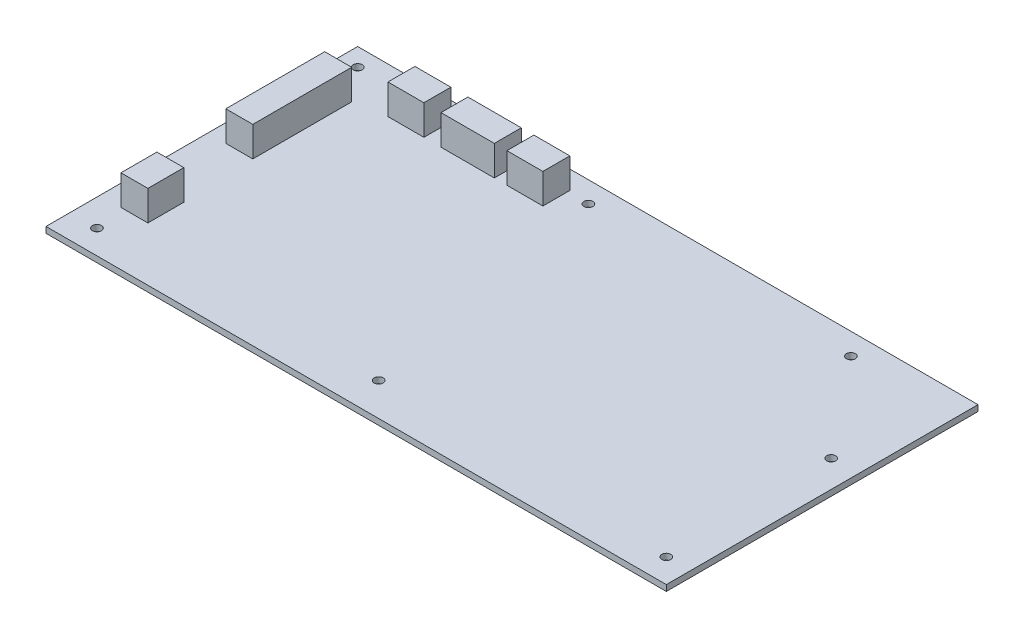
ISO-10303-21;
HEADER;
FILE_DESCRIPTION(('STEP AP214'),'2;1');
FILE_NAME('part.step','',(''),(''),'','','');
FILE_SCHEMA(('AUTOMOTIVE_DESIGN { 1 0 10303 214 1 1 1 1 }'));
ENDSEC;
DATA;
#1=APPLICATION_CONTEXT('core data for automotive mechanical design processes');
#2=APPLICATION_PROTOCOL_DEFINITION('international standard','automotive_design',2000,#1);
#3=PRODUCT_CONTEXT('',#1,'mechanical');
#4=PRODUCT('Part','Part','',(#3));
#5=PRODUCT_RELATED_PRODUCT_CATEGORY('part','',(#4));
#6=PRODUCT_DEFINITION_FORMATION('','',#4);
#7=PRODUCT_DEFINITION_CONTEXT('part definition',#1,'design');
#8=PRODUCT_DEFINITION('design','',#6,#7);
#9=PRODUCT_DEFINITION_SHAPE('','',#8);
#10=(LENGTH_UNIT() NAMED_UNIT(*) SI_UNIT(.MILLI.,.METRE.));
#11=(NAMED_UNIT(*) PLANE_ANGLE_UNIT() SI_UNIT($,.RADIAN.));
#12=(NAMED_UNIT(*) SI_UNIT($,.STERADIAN.) SOLID_ANGLE_UNIT());
#13=UNCERTAINTY_MEASURE_WITH_UNIT(LENGTH_MEASURE(1.E-05),#10,'distance_accuracy_value','');
#14=(GEOMETRIC_REPRESENTATION_CONTEXT(3) GLOBAL_UNCERTAINTY_ASSIGNED_CONTEXT((#13)) GLOBAL_UNIT_ASSIGNED_CONTEXT((#10,
#11,#12)) REPRESENTATION_CONTEXT('',''));
#15=CARTESIAN_POINT('',(0.,0.,0.));
#16=DIRECTION('',(0.,0.,1.));
#17=DIRECTION('',(1.,0.,0.));
#18=AXIS2_PLACEMENT_3D('',#15,#16,#17);
#19=CARTESIAN_POINT('',(0.,2.,0.));
#20=DIRECTION('',(0.,-1.,0.));
#21=DIRECTION('',(0.,0.,-1.));
#22=AXIS2_PLACEMENT_3D('',#19,#20,#21);
#23=PLANE('',#22);
#24=DIRECTION('',(0.,0.,1.));
#25=VECTOR('',#24,1.);
#26=CARTESIAN_POINT('',(-60.5,2.,-45.8));
#27=LINE('',#26,#25);
#28=CARTESIAN_POINT('',(-60.5,2.,-45.8));
#29=VERTEX_POINT('',#28);
#30=CARTESIAN_POINT('',(-60.5,2.,-36.8));
#31=VERTEX_POINT('',#30);
#32=EDGE_CURVE('E225',#29,#31,#27,.T.);
#33=ORIENTED_EDGE('',*,*,#32,.F.);
#34=DIRECTION('',(-1.,0.,0.));
#35=VECTOR('',#34,1.);
#36=CARTESIAN_POINT('',(-60.5,2.,-45.8));
#37=LINE('',#36,#35);
#38=CARTESIAN_POINT('',(-42.7,2.,-45.8));
#39=VERTEX_POINT('',#38);
#40=EDGE_CURVE('E241',#39,#29,#37,.T.);
#41=ORIENTED_EDGE('',*,*,#40,.F.);
#42=DIRECTION('',(0.,0.,-1.));
#43=VECTOR('',#42,1.);
#44=CARTESIAN_POINT('',(-42.7,2.,-45.8));
#45=LINE('',#44,#43);
#46=CARTESIAN_POINT('',(-42.7,2.,-36.8));
#47=VERTEX_POINT('',#46);
#48=EDGE_CURVE('E254',#47,#39,#45,.T.);
#49=ORIENTED_EDGE('',*,*,#48,.F.);
#50=DIRECTION('',(1.,0.,0.));
#51=VECTOR('',#50,1.);
#52=CARTESIAN_POINT('',(-60.5,2.,-36.8));
#53=LINE('',#52,#51);
#54=EDGE_CURVE('E230',#31,#47,#53,.T.);
#55=ORIENTED_EDGE('',*,*,#54,.F.);
#56=EDGE_LOOP('',(#33,#41,#49,#55));
#57=FACE_BOUND('',#56,.T.);
#58=DIRECTION('',(0.,0.,1.));
#59=VECTOR('',#58,1.);
#60=CARTESIAN_POINT('',(-96.5,2.,22.));
#61=LINE('',#60,#59);
#62=CARTESIAN_POINT('',(-96.5,2.,22.));
#63=VERTEX_POINT('',#62);
#64=CARTESIAN_POINT('',(-96.5,2.,34.));
#65=VERTEX_POINT('',#64);
#66=EDGE_CURVE('E321',#63,#65,#61,.T.);
#67=ORIENTED_EDGE('',*,*,#66,.F.);
#68=DIRECTION('',(-1.,0.,0.));
#69=VECTOR('',#68,1.);
#70=CARTESIAN_POINT('',(-96.5,2.,22.));
#71=LINE('',#70,#69);
#72=CARTESIAN_POINT('',(-87.5,2.,22.));
#73=VERTEX_POINT('',#72);
#74=EDGE_CURVE('E327',#73,#63,#71,.T.);
#75=ORIENTED_EDGE('',*,*,#74,.F.);
#76=DIRECTION('',(0.,0.,-1.));
#77=VECTOR('',#76,1.);
#78=CARTESIAN_POINT('',(-87.5,2.,22.));
#79=LINE('',#78,#77);
#80=CARTESIAN_POINT('',(-87.5,2.,34.));
#81=VERTEX_POINT('',#80);
#82=EDGE_CURVE('E344',#81,#73,#79,.T.);
#83=ORIENTED_EDGE('',*,*,#82,.F.);
#84=DIRECTION('',(1.,0.,0.));
#85=VECTOR('',#84,1.);
#86=CARTESIAN_POINT('',(-96.5,2.,34.));
#87=LINE('',#86,#85);
#88=EDGE_CURVE('E340',#65,#81,#87,.T.);
#89=ORIENTED_EDGE('',*,*,#88,.F.);
#90=EDGE_LOOP('',(#67,#75,#83,#89));
#91=FACE_BOUND('',#90,.T.);
#92=DIRECTION('',(0.,0.,-1.));
#93=VECTOR('',#92,1.);
#94=CARTESIAN_POINT('',(103.5,2.,52.));
#95=LINE('',#94,#93);
#96=CARTESIAN_POINT('',(103.5,2.,52.));
#97=VERTEX_POINT('',#96);
#98=CARTESIAN_POINT('',(103.5,2.,-52.));
#99=VERTEX_POINT('',#98);
#100=EDGE_CURVE('E468',#97,#99,#95,.T.);
#101=ORIENTED_EDGE('',*,*,#100,.T.);
#102=DIRECTION('',(-1.,0.,0.));
#103=VECTOR('',#102,1.);
#104=CARTESIAN_POINT('',(-103.5,2.,-52.));
#105=LINE('',#104,#103);
#106=CARTESIAN_POINT('',(-103.5,2.,-52.));
#107=VERTEX_POINT('',#106);
#108=EDGE_CURVE('E472',#99,#107,#105,.T.);
#109=ORIENTED_EDGE('',*,*,#108,.T.);
#110=DIRECTION('',(0.,0.,1.));
#111=VECTOR('',#110,1.);
#112=CARTESIAN_POINT('',(-103.5,2.,52.));
#113=LINE('',#112,#111);
#114=CARTESIAN_POINT('',(-103.5,2.,52.));
#115=VERTEX_POINT('',#114);
#116=EDGE_CURVE('E476',#107,#115,#113,.T.);
#117=ORIENTED_EDGE('',*,*,#116,.T.);
#118=DIRECTION('',(1.,0.,0.));
#119=VECTOR('',#118,1.);
#120=CARTESIAN_POINT('',(-103.5,2.,52.));
#121=LINE('',#120,#119);
#122=EDGE_CURVE('E479',#115,#97,#121,.T.);
#123=ORIENTED_EDGE('',*,*,#122,.T.);
#124=EDGE_LOOP('',(#101,#109,#117,#123));
#125=FACE_BOUND('',#124,.T.);
#126=CARTESIAN_POINT('',(-97.5,2.,-46.));
#127=DIRECTION('',(0.,1.,0.));
#128=DIRECTION('',(0.,0.,1.));
#129=AXIS2_PLACEMENT_3D('',#126,#127,#128);
#130=CIRCLE('',#129,1.5);
#131=CARTESIAN_POINT('',(-97.5,2.,-44.5));
#132=VERTEX_POINT('',#131);
#133=EDGE_CURVE('E432',#132,#132,#130,.T.);
#134=ORIENTED_EDGE('',*,*,#133,.F.);
#135=EDGE_LOOP('',(#134));
#136=FACE_BOUND('',#135,.T.);
#137=CARTESIAN_POINT('',(-94.5,2.,44.));
#138=DIRECTION('',(0.,1.,0.));
#139=DIRECTION('',(0.,0.,1.));
#140=AXIS2_PLACEMENT_3D('',#137,#138,#139);
#141=CIRCLE('',#140,1.5);
#142=CARTESIAN_POINT('',(-94.5,2.,45.5));
#143=VERTEX_POINT('',#142);
#144=EDGE_CURVE('E411',#143,#143,#141,.T.);
#145=ORIENTED_EDGE('',*,*,#144,.F.);
#146=EDGE_LOOP('',(#145));
#147=FACE_BOUND('',#146,.T.);
#148=CARTESIAN_POINT('',(-3.50000000000002,2.,41.));
#149=DIRECTION('',(0.,1.,0.));
#150=DIRECTION('',(0.,0.,1.));
#151=AXIS2_PLACEMENT_3D('',#148,#149,#150);
#152=CIRCLE('',#151,1.5);
#153=CARTESIAN_POINT('',(-3.50000000000002,2.,42.5));
#154=VERTEX_POINT('',#153);
#155=EDGE_CURVE('E417',#154,#154,#152,.T.);
#156=ORIENTED_EDGE('',*,*,#155,.F.);
#157=EDGE_LOOP('',(#156));
#158=FACE_BOUND('',#157,.T.);
#159=CARTESIAN_POINT('',(95.5,2.,44.));
#160=DIRECTION('',(0.,1.,0.));
#161=DIRECTION('',(0.,0.,1.));
#162=AXIS2_PLACEMENT_3D('',#159,#160,#161);
#163=CIRCLE('',#162,1.5);
#164=CARTESIAN_POINT('',(95.5,2.,45.5));
#165=VERTEX_POINT('',#164);
#166=EDGE_CURVE('E416',#165,#165,#163,.T.);
#167=ORIENTED_EDGE('',*,*,#166,.F.);
#168=EDGE_LOOP('',(#167));
#169=FACE_BOUND('',#168,.T.);
#170=CARTESIAN_POINT('',(94.5,2.,-12.));
#171=DIRECTION('',(0.,1.,0.));
#172=DIRECTION('',(0.,0.,1.));
#173=AXIS2_PLACEMENT_3D('',#170,#171,#172);
#174=CIRCLE('',#173,1.5);
#175=CARTESIAN_POINT('',(94.5,2.,-10.5));
#176=VERTEX_POINT('',#175);
#177=EDGE_CURVE('E449',#176,#176,#174,.T.);
#178=ORIENTED_EDGE('',*,*,#177,.F.);
#179=EDGE_LOOP('',(#178));
#180=FACE_BOUND('',#179,.T.);
#181=CARTESIAN_POINT('',(68.3,2.,-44.8));
#182=DIRECTION('',(0.,1.,0.));
#183=DIRECTION('',(0.,0.,1.));
#184=AXIS2_PLACEMENT_3D('',#181,#182,#183);
#185=CIRCLE('',#184,1.5);
#186=CARTESIAN_POINT('',(68.3,2.,-43.3));
#187=VERTEX_POINT('',#186);
#188=EDGE_CURVE('E441',#187,#187,#185,.T.);
#189=ORIENTED_EDGE('',*,*,#188,.F.);
#190=EDGE_LOOP('',(#189));
#191=FACE_BOUND('',#190,.T.);
#192=CARTESIAN_POINT('',(-19.5,2.,-45.));
#193=DIRECTION('',(0.,1.,0.));
#194=DIRECTION('',(0.,0.,1.));
#195=AXIS2_PLACEMENT_3D('',#192,#193,#194);
#196=CIRCLE('',#195,1.5);
#197=CARTESIAN_POINT('',(-19.5,2.,-43.5));
#198=VERTEX_POINT('',#197);
#199=EDGE_CURVE('E433',#198,#198,#196,.T.);
#200=ORIENTED_EDGE('',*,*,#199,.F.);
#201=EDGE_LOOP('',(#200));
#202=FACE_BOUND('',#201,.T.);
#203=DIRECTION('',(0.,0.,1.));
#204=VECTOR('',#203,1.);
#205=CARTESIAN_POINT('',(-97.5,2.,-35.));
#206=LINE('',#205,#204);
#207=CARTESIAN_POINT('',(-97.5,2.,-35.));
#208=VERTEX_POINT('',#207);
#209=CARTESIAN_POINT('',(-97.5,2.,-1.99999999999999));
#210=VERTEX_POINT('',#209);
#211=EDGE_CURVE('E366',#208,#210,#206,.T.);
#212=ORIENTED_EDGE('',*,*,#211,.F.);
#213=DIRECTION('',(-1.,0.,0.));
#214=VECTOR('',#213,1.);
#215=CARTESIAN_POINT('',(-97.5,2.,-35.));
#216=LINE('',#215,#214);
#217=CARTESIAN_POINT('',(-88.5,2.,-35.));
#218=VERTEX_POINT('',#217);
#219=EDGE_CURVE('E372',#218,#208,#216,.T.);
#220=ORIENTED_EDGE('',*,*,#219,.F.);
#221=DIRECTION('',(0.,0.,-1.));
#222=VECTOR('',#221,1.);
#223=CARTESIAN_POINT('',(-88.5,2.,-35.));
#224=LINE('',#223,#222);
#225=CARTESIAN_POINT('',(-88.5,2.,-1.99999999999999));
#226=VERTEX_POINT('',#225);
#227=EDGE_CURVE('E389',#226,#218,#224,.T.);
#228=ORIENTED_EDGE('',*,*,#227,.F.);
#229=DIRECTION('',(1.,0.,0.));
#230=VECTOR('',#229,1.);
#231=CARTESIAN_POINT('',(-97.5,2.,-1.99999999999999));
#232=LINE('',#231,#230);
#233=EDGE_CURVE('E385',#210,#226,#232,.T.);
#234=ORIENTED_EDGE('',*,*,#233,.F.);
#235=EDGE_LOOP('',(#212,#220,#228,#234));
#236=FACE_BOUND('',#235,.T.);
#237=DIRECTION('',(0.,0.,1.));
#238=VECTOR('',#237,1.);
#239=CARTESIAN_POINT('',(-78.2,2.,-45.8));
#240=LINE('',#239,#238);
#241=CARTESIAN_POINT('',(-78.2,2.,-45.8));
#242=VERTEX_POINT('',#241);
#243=CARTESIAN_POINT('',(-78.2,2.,-36.8));
#244=VERTEX_POINT('',#243);
#245=EDGE_CURVE('E276',#242,#244,#240,.T.);
#246=ORIENTED_EDGE('',*,*,#245,.F.);
#247=DIRECTION('',(-1.,0.,0.));
#248=VECTOR('',#247,1.);
#249=CARTESIAN_POINT('',(-78.2,2.,-45.8));
#250=LINE('',#249,#248);
#251=CARTESIAN_POINT('',(-66.2,2.,-45.8));
#252=VERTEX_POINT('',#251);
#253=EDGE_CURVE('E282',#252,#242,#250,.T.);
#254=ORIENTED_EDGE('',*,*,#253,.F.);
#255=DIRECTION('',(0.,0.,-1.));
#256=VECTOR('',#255,1.);
#257=CARTESIAN_POINT('',(-66.2,2.,-45.8));
#258=LINE('',#257,#256);
#259=CARTESIAN_POINT('',(-66.2,2.,-36.8));
#260=VERTEX_POINT('',#259);
#261=EDGE_CURVE('E299',#260,#252,#258,.T.);
#262=ORIENTED_EDGE('',*,*,#261,.F.);
#263=DIRECTION('',(1.,0.,0.));
#264=VECTOR('',#263,1.);
#265=CARTESIAN_POINT('',(-78.2,2.,-36.8));
#266=LINE('',#265,#264);
#267=EDGE_CURVE('E295',#244,#260,#266,.T.);
#268=ORIENTED_EDGE('',*,*,#267,.F.);
#269=EDGE_LOOP('',(#246,#254,#262,#268));
#270=FACE_BOUND('',#269,.T.);
#271=DIRECTION('',(0.,0.,1.));
#272=VECTOR('',#271,1.);
#273=CARTESIAN_POINT('',(-38.5,2.,-45.8));
#274=LINE('',#273,#272);
#275=CARTESIAN_POINT('',(-38.5,2.,-45.8));
#276=VERTEX_POINT('',#275);
#277=CARTESIAN_POINT('',(-38.5,2.,-36.8));
#278=VERTEX_POINT('',#277);
#279=EDGE_CURVE('E223',#276,#278,#274,.T.);
#280=ORIENTED_EDGE('',*,*,#279,.F.);
#281=DIRECTION('',(-1.,0.,0.));
#282=VECTOR('',#281,1.);
#283=CARTESIAN_POINT('',(-38.5,2.,-45.8));
#284=LINE('',#283,#282);
#285=CARTESIAN_POINT('',(-26.5,2.,-45.8));
#286=VERTEX_POINT('',#285);
#287=EDGE_CURVE('E220',#286,#276,#284,.T.);
#288=ORIENTED_EDGE('',*,*,#287,.F.);
#289=DIRECTION('',(0.,0.,-1.));
#290=VECTOR('',#289,1.);
#291=CARTESIAN_POINT('',(-26.5,2.,-45.8));
#292=LINE('',#291,#290);
#293=CARTESIAN_POINT('',(-26.5,2.,-36.8));
#294=VERTEX_POINT('',#293);
#295=EDGE_CURVE('E60',#294,#286,#292,.T.);
#296=ORIENTED_EDGE('',*,*,#295,.F.);
#297=DIRECTION('',(1.,0.,0.));
#298=VECTOR('',#297,1.);
#299=CARTESIAN_POINT('',(-38.5,2.,-36.8));
#300=LINE('',#299,#298);
#301=EDGE_CURVE('E55',#278,#294,#300,.T.);
#302=ORIENTED_EDGE('',*,*,#301,.F.);
#303=EDGE_LOOP('',(#280,#288,#296,#302));
#304=FACE_BOUND('',#303,.T.);
#305=ADVANCED_FACE('F39',(#57,#91,#125,#136,#147,#158,#169,#180,#191,#202,#236,#270,#304),#23,.F.);
#306=CARTESIAN_POINT('',(103.5,2.,52.));
#307=DIRECTION('',(-1.,0.,0.));
#308=DIRECTION('',(0.,0.,1.));
#309=AXIS2_PLACEMENT_3D('',#306,#307,#308);
#310=PLANE('',#309);
#311=DIRECTION('',(0.,0.,-1.));
#312=VECTOR('',#311,1.);
#313=CARTESIAN_POINT('',(103.5,0.,52.));
#314=LINE('',#313,#312);
#315=CARTESIAN_POINT('',(103.5,0.,52.));
#316=VERTEX_POINT('',#315);
#317=CARTESIAN_POINT('',(103.5,0.,-52.));
#318=VERTEX_POINT('',#317);
#319=EDGE_CURVE('E464',#316,#318,#314,.T.);
#320=ORIENTED_EDGE('',*,*,#319,.T.);
#321=DIRECTION('',(0.,-1.,0.));
#322=VECTOR('',#321,1.);
#323=CARTESIAN_POINT('',(103.5,2.,-52.));
#324=LINE('',#323,#322);
#325=EDGE_CURVE('E11',#99,#318,#324,.T.);
#326=ORIENTED_EDGE('',*,*,#325,.F.);
#327=ORIENTED_EDGE('',*,*,#100,.F.);
#328=DIRECTION('',(0.,-1.,0.));
#329=VECTOR('',#328,1.);
#330=CARTESIAN_POINT('',(103.5,2.,52.));
#331=LINE('',#330,#329);
#332=EDGE_CURVE('E482',#97,#316,#331,.T.);
#333=ORIENTED_EDGE('',*,*,#332,.T.);
#334=EDGE_LOOP('',(#320,#326,#327,#333));
#335=FACE_BOUND('',#334,.T.);
#336=ADVANCED_FACE('F41',(#335),#310,.F.);
#337=CARTESIAN_POINT('',(-103.5,2.,-52.));
#338=DIRECTION('',(0.,0.,1.));
#339=DIRECTION('',(1.,0.,0.));
#340=AXIS2_PLACEMENT_3D('',#337,#338,#339);
#341=PLANE('',#340);
#342=DIRECTION('',(-1.,0.,0.));
#343=VECTOR('',#342,1.);
#344=CARTESIAN_POINT('',(-103.5,0.,-52.));
#345=LINE('',#344,#343);
#346=CARTESIAN_POINT('',(-103.5,0.,-52.));
#347=VERTEX_POINT('',#346);
#348=EDGE_CURVE('E486',#318,#347,#345,.T.);
#349=ORIENTED_EDGE('',*,*,#348,.T.);
#350=DIRECTION('',(0.,-1.,0.));
#351=VECTOR('',#350,1.);
#352=CARTESIAN_POINT('',(-103.5,2.,-52.));
#353=LINE('',#352,#351);
#354=EDGE_CURVE('E48',#107,#347,#353,.T.);
#355=ORIENTED_EDGE('',*,*,#354,.F.);
#356=ORIENTED_EDGE('',*,*,#108,.F.);
#357=ORIENTED_EDGE('',*,*,#325,.T.);
#358=EDGE_LOOP('',(#349,#355,#356,#357));
#359=FACE_BOUND('',#358,.T.);
#360=ADVANCED_FACE('F522',(#359),#341,.F.);
#361=CARTESIAN_POINT('',(-103.5,2.,52.));
#362=DIRECTION('',(1.,0.,0.));
#363=DIRECTION('',(0.,0.,-1.));
#364=AXIS2_PLACEMENT_3D('',#361,#362,#363);
#365=PLANE('',#364);
#366=DIRECTION('',(0.,0.,1.));
#367=VECTOR('',#366,1.);
#368=CARTESIAN_POINT('',(-103.5,0.,52.));
#369=LINE('',#368,#367);
#370=CARTESIAN_POINT('',(-103.5,0.,52.));
#371=VERTEX_POINT('',#370);
#372=EDGE_CURVE('E489',#347,#371,#369,.T.);
#373=ORIENTED_EDGE('',*,*,#372,.T.);
#374=DIRECTION('',(0.,-1.,0.));
#375=VECTOR('',#374,1.);
#376=CARTESIAN_POINT('',(-103.5,2.,52.));
#377=LINE('',#376,#375);
#378=EDGE_CURVE('E497',#115,#371,#377,.T.);
#379=ORIENTED_EDGE('',*,*,#378,.F.);
#380=ORIENTED_EDGE('',*,*,#116,.F.);
#381=ORIENTED_EDGE('',*,*,#354,.T.);
#382=EDGE_LOOP('',(#373,#379,#380,#381));
#383=FACE_BOUND('',#382,.T.);
#384=ADVANCED_FACE('F506',(#383),#365,.F.);
#385=CARTESIAN_POINT('',(-103.5,2.,52.));
#386=DIRECTION('',(0.,0.,-1.));
#387=DIRECTION('',(-1.,0.,0.));
#388=AXIS2_PLACEMENT_3D('',#385,#386,#387);
#389=PLANE('',#388);
#390=DIRECTION('',(1.,0.,0.));
#391=VECTOR('',#390,1.);
#392=CARTESIAN_POINT('',(-103.5,0.,52.));
#393=LINE('',#392,#391);
#394=EDGE_CURVE('E473',#371,#316,#393,.T.);
#395=ORIENTED_EDGE('',*,*,#394,.T.);
#396=ORIENTED_EDGE('',*,*,#332,.F.);
#397=ORIENTED_EDGE('',*,*,#122,.F.);
#398=ORIENTED_EDGE('',*,*,#378,.T.);
#399=EDGE_LOOP('',(#395,#396,#397,#398));
#400=FACE_BOUND('',#399,.T.);
#401=ADVANCED_FACE('F515',(#400),#389,.F.);
#402=CARTESIAN_POINT('',(0.,0.,0.));
#403=DIRECTION('',(0.,-1.,0.));
#404=DIRECTION('',(0.,0.,-1.));
#405=AXIS2_PLACEMENT_3D('',#402,#403,#404);
#406=PLANE('',#405);
#407=CARTESIAN_POINT('',(-19.5,0.,-45.));
#408=DIRECTION('',(0.,1.,0.));
#409=DIRECTION('',(0.,0.,1.));
#410=AXIS2_PLACEMENT_3D('',#407,#408,#409);
#411=CIRCLE('',#410,1.5);
#412=CARTESIAN_POINT('',(-19.5,0.,-43.5));
#413=VERTEX_POINT('',#412);
#414=EDGE_CURVE('E428',#413,#413,#411,.T.);
#415=ORIENTED_EDGE('',*,*,#414,.T.);
#416=EDGE_LOOP('',(#415));
#417=FACE_BOUND('',#416,.T.);
#418=CARTESIAN_POINT('',(68.3,0.,-44.8));
#419=DIRECTION('',(0.,1.,0.));
#420=DIRECTION('',(0.,0.,1.));
#421=AXIS2_PLACEMENT_3D('',#418,#419,#420);
#422=CIRCLE('',#421,1.5);
#423=CARTESIAN_POINT('',(68.3,0.,-43.3));
#424=VERTEX_POINT('',#423);
#425=EDGE_CURVE('E437',#424,#424,#422,.T.);
#426=ORIENTED_EDGE('',*,*,#425,.T.);
#427=EDGE_LOOP('',(#426));
#428=FACE_BOUND('',#427,.T.);
#429=CARTESIAN_POINT('',(94.5,0.,-12.));
#430=DIRECTION('',(0.,1.,0.));
#431=DIRECTION('',(0.,0.,1.));
#432=AXIS2_PLACEMENT_3D('',#429,#430,#431);
#433=CIRCLE('',#432,1.5);
#434=CARTESIAN_POINT('',(94.5,0.,-10.5));
#435=VERTEX_POINT('',#434);
#436=EDGE_CURVE('E445',#435,#435,#433,.T.);
#437=ORIENTED_EDGE('',*,*,#436,.T.);
#438=EDGE_LOOP('',(#437));
#439=FACE_BOUND('',#438,.T.);
#440=CARTESIAN_POINT('',(95.5,0.,44.));
#441=DIRECTION('',(0.,1.,0.));
#442=DIRECTION('',(0.,0.,1.));
#443=AXIS2_PLACEMENT_3D('',#440,#441,#442);
#444=CIRCLE('',#443,1.5);
#445=CARTESIAN_POINT('',(95.5,0.,45.5));
#446=VERTEX_POINT('',#445);
#447=EDGE_CURVE('E453',#446,#446,#444,.T.);
#448=ORIENTED_EDGE('',*,*,#447,.T.);
#449=EDGE_LOOP('',(#448));
#450=FACE_BOUND('',#449,.T.);
#451=CARTESIAN_POINT('',(-3.50000000000002,0.,41.));
#452=DIRECTION('',(0.,1.,0.));
#453=DIRECTION('',(0.,0.,1.));
#454=AXIS2_PLACEMENT_3D('',#451,#452,#453);
#455=CIRCLE('',#454,1.5);
#456=CARTESIAN_POINT('',(-3.50000000000002,0.,42.5));
#457=VERTEX_POINT('',#456);
#458=EDGE_CURVE('E412',#457,#457,#455,.T.);
#459=ORIENTED_EDGE('',*,*,#458,.T.);
#460=EDGE_LOOP('',(#459));
#461=FACE_BOUND('',#460,.T.);
#462=CARTESIAN_POINT('',(-94.5,0.,44.));
#463=DIRECTION('',(0.,1.,0.));
#464=DIRECTION('',(0.,0.,1.));
#465=AXIS2_PLACEMENT_3D('',#462,#463,#464);
#466=CIRCLE('',#465,1.5);
#467=CARTESIAN_POINT('',(-94.5,0.,45.5));
#468=VERTEX_POINT('',#467);
#469=EDGE_CURVE('E421',#468,#468,#466,.T.);
#470=ORIENTED_EDGE('',*,*,#469,.T.);
#471=EDGE_LOOP('',(#470));
#472=FACE_BOUND('',#471,.T.);
#473=CARTESIAN_POINT('',(-97.5,0.,-46.));
#474=DIRECTION('',(0.,1.,0.));
#475=DIRECTION('',(0.,0.,1.));
#476=AXIS2_PLACEMENT_3D('',#473,#474,#475);
#477=CIRCLE('',#476,1.5);
#478=CARTESIAN_POINT('',(-97.5,0.,-44.5));
#479=VERTEX_POINT('',#478);
#480=EDGE_CURVE('E460',#479,#479,#477,.T.);
#481=ORIENTED_EDGE('',*,*,#480,.T.);
#482=EDGE_LOOP('',(#481));
#483=FACE_BOUND('',#482,.T.);
#484=ORIENTED_EDGE('',*,*,#319,.F.);
#485=ORIENTED_EDGE('',*,*,#394,.F.);
#486=ORIENTED_EDGE('',*,*,#372,.F.);
#487=ORIENTED_EDGE('',*,*,#348,.F.);
#488=EDGE_LOOP('',(#484,#485,#486,#487));
#489=FACE_BOUND('',#488,.T.);
#490=ADVANCED_FACE('F512',(#417,#428,#439,#450,#461,#472,#483,#489),#406,.T.);
#491=CARTESIAN_POINT('',(-97.5,0.,-46.));
#492=DIRECTION('',(0.,1.,0.));
#493=DIRECTION('',(0.,0.,1.));
#494=AXIS2_PLACEMENT_3D('',#491,#492,#493);
#495=CYLINDRICAL_SURFACE('',#494,1.5);
#496=ORIENTED_EDGE('',*,*,#480,.F.);
#497=EDGE_LOOP('',(#496));
#498=FACE_BOUND('',#497,.T.);
#499=ORIENTED_EDGE('',*,*,#133,.T.);
#500=EDGE_LOOP('',(#499));
#501=FACE_BOUND('',#500,.T.);
#502=ADVANCED_FACE('F537',(#498,#501),#495,.F.);
#503=CARTESIAN_POINT('',(-94.5,0.,44.));
#504=DIRECTION('',(0.,1.,0.));
#505=DIRECTION('',(0.,0.,1.));
#506=AXIS2_PLACEMENT_3D('',#503,#504,#505);
#507=CYLINDRICAL_SURFACE('',#506,1.5);
#508=ORIENTED_EDGE('',*,*,#469,.F.);
#509=EDGE_LOOP('',(#508));
#510=FACE_BOUND('',#509,.T.);
#511=ORIENTED_EDGE('',*,*,#144,.T.);
#512=EDGE_LOOP('',(#511));
#513=FACE_BOUND('',#512,.T.);
#514=ADVANCED_FACE('F557',(#510,#513),#507,.F.);
#515=CARTESIAN_POINT('',(-3.50000000000002,0.,41.));
#516=DIRECTION('',(0.,1.,0.));
#517=DIRECTION('',(0.,0.,1.));
#518=AXIS2_PLACEMENT_3D('',#515,#516,#517);
#519=CYLINDRICAL_SURFACE('',#518,1.5);
#520=ORIENTED_EDGE('',*,*,#458,.F.);
#521=EDGE_LOOP('',(#520));
#522=FACE_BOUND('',#521,.T.);
#523=ORIENTED_EDGE('',*,*,#155,.T.);
#524=EDGE_LOOP('',(#523));
#525=FACE_BOUND('',#524,.T.);
#526=ADVANCED_FACE('F564',(#522,#525),#519,.F.);
#527=CARTESIAN_POINT('',(95.5,0.,44.));
#528=DIRECTION('',(0.,1.,0.));
#529=DIRECTION('',(0.,0.,1.));
#530=AXIS2_PLACEMENT_3D('',#527,#528,#529);
#531=CYLINDRICAL_SURFACE('',#530,1.5);
#532=ORIENTED_EDGE('',*,*,#447,.F.);
#533=EDGE_LOOP('',(#532));
#534=FACE_BOUND('',#533,.T.);
#535=ORIENTED_EDGE('',*,*,#166,.T.);
#536=EDGE_LOOP('',(#535));
#537=FACE_BOUND('',#536,.T.);
#538=ADVANCED_FACE('F572',(#534,#537),#531,.F.);
#539=CARTESIAN_POINT('',(94.5,0.,-12.));
#540=DIRECTION('',(0.,1.,0.));
#541=DIRECTION('',(0.,0.,1.));
#542=AXIS2_PLACEMENT_3D('',#539,#540,#541);
#543=CYLINDRICAL_SURFACE('',#542,1.5);
#544=ORIENTED_EDGE('',*,*,#436,.F.);
#545=EDGE_LOOP('',(#544));
#546=FACE_BOUND('',#545,.T.);
#547=ORIENTED_EDGE('',*,*,#177,.T.);
#548=EDGE_LOOP('',(#547));
#549=FACE_BOUND('',#548,.T.);
#550=ADVANCED_FACE('F580',(#546,#549),#543,.F.);
#551=CARTESIAN_POINT('',(68.3,0.,-44.8));
#552=DIRECTION('',(0.,1.,0.));
#553=DIRECTION('',(0.,0.,1.));
#554=AXIS2_PLACEMENT_3D('',#551,#552,#553);
#555=CYLINDRICAL_SURFACE('',#554,1.5);
#556=ORIENTED_EDGE('',*,*,#425,.F.);
#557=EDGE_LOOP('',(#556));
#558=FACE_BOUND('',#557,.T.);
#559=ORIENTED_EDGE('',*,*,#188,.T.);
#560=EDGE_LOOP('',(#559));
#561=FACE_BOUND('',#560,.T.);
#562=ADVANCED_FACE('F587',(#558,#561),#555,.F.);
#563=CARTESIAN_POINT('',(-19.5,0.,-45.));
#564=DIRECTION('',(0.,1.,0.));
#565=DIRECTION('',(0.,0.,1.));
#566=AXIS2_PLACEMENT_3D('',#563,#564,#565);
#567=CYLINDRICAL_SURFACE('',#566,1.5);
#568=ORIENTED_EDGE('',*,*,#414,.F.);
#569=EDGE_LOOP('',(#568));
#570=FACE_BOUND('',#569,.T.);
#571=ORIENTED_EDGE('',*,*,#199,.T.);
#572=EDGE_LOOP('',(#571));
#573=FACE_BOUND('',#572,.T.);
#574=ADVANCED_FACE('F595',(#570,#573),#567,.F.);
#575=CARTESIAN_POINT('',(-97.5,12.,-35.));
#576=DIRECTION('',(1.,0.,0.));
#577=DIRECTION('',(0.,0.,-1.));
#578=AXIS2_PLACEMENT_3D('',#575,#576,#577);
#579=PLANE('',#578);
#580=ORIENTED_EDGE('',*,*,#211,.T.);
#581=DIRECTION('',(0.,-1.,0.));
#582=VECTOR('',#581,1.);
#583=CARTESIAN_POINT('',(-97.5,12.,-1.99999999999999));
#584=LINE('',#583,#582);
#585=CARTESIAN_POINT('',(-97.5,12.,-1.99999999999999));
#586=VERTEX_POINT('',#585);
#587=EDGE_CURVE('E407',#586,#210,#584,.T.);
#588=ORIENTED_EDGE('',*,*,#587,.F.);
#589=DIRECTION('',(0.,0.,1.));
#590=VECTOR('',#589,1.);
#591=CARTESIAN_POINT('',(-97.5,12.,-35.));
#592=LINE('',#591,#590);
#593=CARTESIAN_POINT('',(-97.5,12.,-35.));
#594=VERTEX_POINT('',#593);
#595=EDGE_CURVE('E367',#594,#586,#592,.T.);
#596=ORIENTED_EDGE('',*,*,#595,.F.);
#597=DIRECTION('',(0.,-1.,0.));
#598=VECTOR('',#597,1.);
#599=CARTESIAN_POINT('',(-97.5,12.,-35.));
#600=LINE('',#599,#598);
#601=EDGE_CURVE('E381',#594,#208,#600,.T.);
#602=ORIENTED_EDGE('',*,*,#601,.T.);
#603=EDGE_LOOP('',(#580,#588,#596,#602));
#604=FACE_BOUND('',#603,.T.);
#605=ADVANCED_FACE('F603',(#604),#579,.F.);
#606=CARTESIAN_POINT('',(-97.5,12.,-1.99999999999999));
#607=DIRECTION('',(0.,0.,-1.));
#608=DIRECTION('',(-1.,0.,0.));
#609=AXIS2_PLACEMENT_3D('',#606,#607,#608);
#610=PLANE('',#609);
#611=ORIENTED_EDGE('',*,*,#233,.T.);
#612=DIRECTION('',(0.,-1.,0.));
#613=VECTOR('',#612,1.);
#614=CARTESIAN_POINT('',(-88.5,12.,-1.99999999999999));
#615=LINE('',#614,#613);
#616=CARTESIAN_POINT('',(-88.5,12.,-1.99999999999999));
#617=VERTEX_POINT('',#616);
#618=EDGE_CURVE('E403',#617,#226,#615,.T.);
#619=ORIENTED_EDGE('',*,*,#618,.F.);
#620=DIRECTION('',(1.,0.,0.));
#621=VECTOR('',#620,1.);
#622=CARTESIAN_POINT('',(-97.5,12.,-1.99999999999999));
#623=LINE('',#622,#621);
#624=EDGE_CURVE('E371',#586,#617,#623,.T.);
#625=ORIENTED_EDGE('',*,*,#624,.F.);
#626=ORIENTED_EDGE('',*,*,#587,.T.);
#627=EDGE_LOOP('',(#611,#619,#625,#626));
#628=FACE_BOUND('',#627,.T.);
#629=ADVANCED_FACE('F611',(#628),#610,.F.);
#630=CARTESIAN_POINT('',(-88.5,12.,-35.));
#631=DIRECTION('',(-1.,0.,0.));
#632=DIRECTION('',(0.,0.,1.));
#633=AXIS2_PLACEMENT_3D('',#630,#631,#632);
#634=PLANE('',#633);
#635=ORIENTED_EDGE('',*,*,#227,.T.);
#636=DIRECTION('',(0.,-1.,0.));
#637=VECTOR('',#636,1.);
#638=CARTESIAN_POINT('',(-88.5,12.,-35.));
#639=LINE('',#638,#637);
#640=CARTESIAN_POINT('',(-88.5,12.,-35.));
#641=VERTEX_POINT('',#640);
#642=EDGE_CURVE('E399',#641,#218,#639,.T.);
#643=ORIENTED_EDGE('',*,*,#642,.F.);
#644=DIRECTION('',(0.,0.,-1.));
#645=VECTOR('',#644,1.);
#646=CARTESIAN_POINT('',(-88.5,12.,-35.));
#647=LINE('',#646,#645);
#648=EDGE_CURVE('E375',#617,#641,#647,.T.);
#649=ORIENTED_EDGE('',*,*,#648,.F.);
#650=ORIENTED_EDGE('',*,*,#618,.T.);
#651=EDGE_LOOP('',(#635,#643,#649,#650));
#652=FACE_BOUND('',#651,.T.);
#653=ADVANCED_FACE('F619',(#652),#634,.F.);
#654=CARTESIAN_POINT('',(-97.5,12.,-35.));
#655=DIRECTION('',(0.,0.,1.));
#656=DIRECTION('',(1.,0.,0.));
#657=AXIS2_PLACEMENT_3D('',#654,#655,#656);
#658=PLANE('',#657);
#659=ORIENTED_EDGE('',*,*,#219,.T.);
#660=ORIENTED_EDGE('',*,*,#601,.F.);
#661=DIRECTION('',(-1.,0.,0.));
#662=VECTOR('',#661,1.);
#663=CARTESIAN_POINT('',(-97.5,12.,-35.));
#664=LINE('',#663,#662);
#665=EDGE_CURVE('E378',#641,#594,#664,.T.);
#666=ORIENTED_EDGE('',*,*,#665,.F.);
#667=ORIENTED_EDGE('',*,*,#642,.T.);
#668=EDGE_LOOP('',(#659,#660,#666,#667));
#669=FACE_BOUND('',#668,.T.);
#670=ADVANCED_FACE('F627',(#669),#658,.F.);
#671=CARTESIAN_POINT('',(0.,12.,0.));
#672=DIRECTION('',(0.,1.,0.));
#673=DIRECTION('',(0.,0.,1.));
#674=AXIS2_PLACEMENT_3D('',#671,#672,#673);
#675=PLANE('',#674);
#676=ORIENTED_EDGE('',*,*,#595,.T.);
#677=ORIENTED_EDGE('',*,*,#624,.T.);
#678=ORIENTED_EDGE('',*,*,#648,.T.);
#679=ORIENTED_EDGE('',*,*,#665,.T.);
#680=EDGE_LOOP('',(#676,#677,#678,#679));
#681=FACE_BOUND('',#680,.T.);
#682=ADVANCED_FACE('F635',(#681),#675,.T.);
#683=CARTESIAN_POINT('',(-96.5,12.,22.));
#684=DIRECTION('',(1.,0.,0.));
#685=DIRECTION('',(0.,0.,-1.));
#686=AXIS2_PLACEMENT_3D('',#683,#684,#685);
#687=PLANE('',#686);
#688=ORIENTED_EDGE('',*,*,#66,.T.);
#689=DIRECTION('',(0.,-1.,0.));
#690=VECTOR('',#689,1.);
#691=CARTESIAN_POINT('',(-96.5,12.,34.));
#692=LINE('',#691,#690);
#693=CARTESIAN_POINT('',(-96.5,12.,34.));
#694=VERTEX_POINT('',#693);
#695=EDGE_CURVE('E362',#694,#65,#692,.T.);
#696=ORIENTED_EDGE('',*,*,#695,.F.);
#697=DIRECTION('',(0.,0.,1.));
#698=VECTOR('',#697,1.);
#699=CARTESIAN_POINT('',(-96.5,12.,22.));
#700=LINE('',#699,#698);
#701=CARTESIAN_POINT('',(-96.5,12.,22.));
#702=VERTEX_POINT('',#701);
#703=EDGE_CURVE('E322',#702,#694,#700,.T.);
#704=ORIENTED_EDGE('',*,*,#703,.F.);
#705=DIRECTION('',(0.,-1.,0.));
#706=VECTOR('',#705,1.);
#707=CARTESIAN_POINT('',(-96.5,12.,22.));
#708=LINE('',#707,#706);
#709=EDGE_CURVE('E336',#702,#63,#708,.T.);
#710=ORIENTED_EDGE('',*,*,#709,.T.);
#711=EDGE_LOOP('',(#688,#696,#704,#710));
#712=FACE_BOUND('',#711,.T.);
#713=ADVANCED_FACE('F643',(#712),#687,.F.);
#714=CARTESIAN_POINT('',(-96.5,12.,34.));
#715=DIRECTION('',(0.,0.,-1.));
#716=DIRECTION('',(-1.,0.,0.));
#717=AXIS2_PLACEMENT_3D('',#714,#715,#716);
#718=PLANE('',#717);
#719=ORIENTED_EDGE('',*,*,#88,.T.);
#720=DIRECTION('',(0.,-1.,0.));
#721=VECTOR('',#720,1.);
#722=CARTESIAN_POINT('',(-87.5,12.,34.));
#723=LINE('',#722,#721);
#724=CARTESIAN_POINT('',(-87.5,12.,34.));
#725=VERTEX_POINT('',#724);
#726=EDGE_CURVE('E358',#725,#81,#723,.T.);
#727=ORIENTED_EDGE('',*,*,#726,.F.);
#728=DIRECTION('',(1.,0.,0.));
#729=VECTOR('',#728,1.);
#730=CARTESIAN_POINT('',(-96.5,12.,34.));
#731=LINE('',#730,#729);
#732=EDGE_CURVE('E326',#694,#725,#731,.T.);
#733=ORIENTED_EDGE('',*,*,#732,.F.);
#734=ORIENTED_EDGE('',*,*,#695,.T.);
#735=EDGE_LOOP('',(#719,#727,#733,#734));
#736=FACE_BOUND('',#735,.T.);
#737=ADVANCED_FACE('F651',(#736),#718,.F.);
#738=CARTESIAN_POINT('',(-87.5,12.,22.));
#739=DIRECTION('',(-1.,0.,0.));
#740=DIRECTION('',(0.,0.,1.));
#741=AXIS2_PLACEMENT_3D('',#738,#739,#740);
#742=PLANE('',#741);
#743=ORIENTED_EDGE('',*,*,#82,.T.);
#744=DIRECTION('',(0.,-1.,0.));
#745=VECTOR('',#744,1.);
#746=CARTESIAN_POINT('',(-87.5,12.,22.));
#747=LINE('',#746,#745);
#748=CARTESIAN_POINT('',(-87.5,12.,22.));
#749=VERTEX_POINT('',#748);
#750=EDGE_CURVE('E354',#749,#73,#747,.T.);
#751=ORIENTED_EDGE('',*,*,#750,.F.);
#752=DIRECTION('',(0.,0.,-1.));
#753=VECTOR('',#752,1.);
#754=CARTESIAN_POINT('',(-87.5,12.,22.));
#755=LINE('',#754,#753);
#756=EDGE_CURVE('E330',#725,#749,#755,.T.);
#757=ORIENTED_EDGE('',*,*,#756,.F.);
#758=ORIENTED_EDGE('',*,*,#726,.T.);
#759=EDGE_LOOP('',(#743,#751,#757,#758));
#760=FACE_BOUND('',#759,.T.);
#761=ADVANCED_FACE('F659',(#760),#742,.F.);
#762=CARTESIAN_POINT('',(-96.5,12.,22.));
#763=DIRECTION('',(0.,0.,1.));
#764=DIRECTION('',(1.,0.,0.));
#765=AXIS2_PLACEMENT_3D('',#762,#763,#764);
#766=PLANE('',#765);
#767=ORIENTED_EDGE('',*,*,#74,.T.);
#768=ORIENTED_EDGE('',*,*,#709,.F.);
#769=DIRECTION('',(-1.,0.,0.));
#770=VECTOR('',#769,1.);
#771=CARTESIAN_POINT('',(-96.5,12.,22.));
#772=LINE('',#771,#770);
#773=EDGE_CURVE('E333',#749,#702,#772,.T.);
#774=ORIENTED_EDGE('',*,*,#773,.F.);
#775=ORIENTED_EDGE('',*,*,#750,.T.);
#776=EDGE_LOOP('',(#767,#768,#774,#775));
#777=FACE_BOUND('',#776,.T.);
#778=ADVANCED_FACE('F667',(#777),#766,.F.);
#779=CARTESIAN_POINT('',(0.,12.,0.));
#780=DIRECTION('',(0.,1.,0.));
#781=DIRECTION('',(0.,0.,1.));
#782=AXIS2_PLACEMENT_3D('',#779,#780,#781);
#783=PLANE('',#782);
#784=ORIENTED_EDGE('',*,*,#703,.T.);
#785=ORIENTED_EDGE('',*,*,#732,.T.);
#786=ORIENTED_EDGE('',*,*,#756,.T.);
#787=ORIENTED_EDGE('',*,*,#773,.T.);
#788=EDGE_LOOP('',(#784,#785,#786,#787));
#789=FACE_BOUND('',#788,.T.);
#790=ADVANCED_FACE('F675',(#789),#783,.T.);
#791=CARTESIAN_POINT('',(-78.2,12.,-45.8));
#792=DIRECTION('',(1.,0.,0.));
#793=DIRECTION('',(0.,0.,-1.));
#794=AXIS2_PLACEMENT_3D('',#791,#792,#793);
#795=PLANE('',#794);
#796=ORIENTED_EDGE('',*,*,#245,.T.);
#797=DIRECTION('',(0.,-1.,0.));
#798=VECTOR('',#797,1.);
#799=CARTESIAN_POINT('',(-78.2,12.,-36.8));
#800=LINE('',#799,#798);
#801=CARTESIAN_POINT('',(-78.2,12.,-36.8));
#802=VERTEX_POINT('',#801);
#803=EDGE_CURVE('E317',#802,#244,#800,.T.);
#804=ORIENTED_EDGE('',*,*,#803,.F.);
#805=DIRECTION('',(0.,0.,1.));
#806=VECTOR('',#805,1.);
#807=CARTESIAN_POINT('',(-78.2,12.,-45.8));
#808=LINE('',#807,#806);
#809=CARTESIAN_POINT('',(-78.2,12.,-45.8));
#810=VERTEX_POINT('',#809);
#811=EDGE_CURVE('E277',#810,#802,#808,.T.);
#812=ORIENTED_EDGE('',*,*,#811,.F.);
#813=DIRECTION('',(0.,-1.,0.));
#814=VECTOR('',#813,1.);
#815=CARTESIAN_POINT('',(-78.2,12.,-45.8));
#816=LINE('',#815,#814);
#817=EDGE_CURVE('E291',#810,#242,#816,.T.);
#818=ORIENTED_EDGE('',*,*,#817,.T.);
#819=EDGE_LOOP('',(#796,#804,#812,#818));
#820=FACE_BOUND('',#819,.T.);
#821=ADVANCED_FACE('F683',(#820),#795,.F.);
#822=CARTESIAN_POINT('',(-78.2,12.,-36.8));
#823=DIRECTION('',(0.,0.,-1.));
#824=DIRECTION('',(-1.,0.,0.));
#825=AXIS2_PLACEMENT_3D('',#822,#823,#824);
#826=PLANE('',#825);
#827=ORIENTED_EDGE('',*,*,#267,.T.);
#828=DIRECTION('',(0.,-1.,0.));
#829=VECTOR('',#828,1.);
#830=CARTESIAN_POINT('',(-66.2,12.,-36.8));
#831=LINE('',#830,#829);
#832=CARTESIAN_POINT('',(-66.2,12.,-36.8));
#833=VERTEX_POINT('',#832);
#834=EDGE_CURVE('E313',#833,#260,#831,.T.);
#835=ORIENTED_EDGE('',*,*,#834,.F.);
#836=DIRECTION('',(1.,0.,0.));
#837=VECTOR('',#836,1.);
#838=CARTESIAN_POINT('',(-78.2,12.,-36.8));
#839=LINE('',#838,#837);
#840=EDGE_CURVE('E281',#802,#833,#839,.T.);
#841=ORIENTED_EDGE('',*,*,#840,.F.);
#842=ORIENTED_EDGE('',*,*,#803,.T.);
#843=EDGE_LOOP('',(#827,#835,#841,#842));
#844=FACE_BOUND('',#843,.T.);
#845=ADVANCED_FACE('F691',(#844),#826,.F.);
#846=CARTESIAN_POINT('',(-66.2,12.,-45.8));
#847=DIRECTION('',(-1.,0.,0.));
#848=DIRECTION('',(0.,0.,1.));
#849=AXIS2_PLACEMENT_3D('',#846,#847,#848);
#850=PLANE('',#849);
#851=ORIENTED_EDGE('',*,*,#261,.T.);
#852=DIRECTION('',(0.,-1.,0.));
#853=VECTOR('',#852,1.);
#854=CARTESIAN_POINT('',(-66.2,12.,-45.8));
#855=LINE('',#854,#853);
#856=CARTESIAN_POINT('',(-66.2,12.,-45.8));
#857=VERTEX_POINT('',#856);
#858=EDGE_CURVE('E309',#857,#252,#855,.T.);
#859=ORIENTED_EDGE('',*,*,#858,.F.);
#860=DIRECTION('',(0.,0.,-1.));
#861=VECTOR('',#860,1.);
#862=CARTESIAN_POINT('',(-66.2,12.,-45.8));
#863=LINE('',#862,#861);
#864=EDGE_CURVE('E285',#833,#857,#863,.T.);
#865=ORIENTED_EDGE('',*,*,#864,.F.);
#866=ORIENTED_EDGE('',*,*,#834,.T.);
#867=EDGE_LOOP('',(#851,#859,#865,#866));
#868=FACE_BOUND('',#867,.T.);
#869=ADVANCED_FACE('F699',(#868),#850,.F.);
#870=CARTESIAN_POINT('',(-78.2,12.,-45.8));
#871=DIRECTION('',(0.,0.,1.));
#872=DIRECTION('',(1.,0.,0.));
#873=AXIS2_PLACEMENT_3D('',#870,#871,#872);
#874=PLANE('',#873);
#875=ORIENTED_EDGE('',*,*,#253,.T.);
#876=ORIENTED_EDGE('',*,*,#817,.F.);
#877=DIRECTION('',(-1.,0.,0.));
#878=VECTOR('',#877,1.);
#879=CARTESIAN_POINT('',(-78.2,12.,-45.8));
#880=LINE('',#879,#878);
#881=EDGE_CURVE('E288',#857,#810,#880,.T.);
#882=ORIENTED_EDGE('',*,*,#881,.F.);
#883=ORIENTED_EDGE('',*,*,#858,.T.);
#884=EDGE_LOOP('',(#875,#876,#882,#883));
#885=FACE_BOUND('',#884,.T.);
#886=ADVANCED_FACE('F707',(#885),#874,.F.);
#887=CARTESIAN_POINT('',(0.,12.,0.));
#888=DIRECTION('',(0.,1.,0.));
#889=DIRECTION('',(0.,0.,1.));
#890=AXIS2_PLACEMENT_3D('',#887,#888,#889);
#891=PLANE('',#890);
#892=ORIENTED_EDGE('',*,*,#811,.T.);
#893=ORIENTED_EDGE('',*,*,#840,.T.);
#894=ORIENTED_EDGE('',*,*,#864,.T.);
#895=ORIENTED_EDGE('',*,*,#881,.T.);
#896=EDGE_LOOP('',(#892,#893,#894,#895));
#897=FACE_BOUND('',#896,.T.);
#898=ADVANCED_FACE('F715',(#897),#891,.T.);
#899=CARTESIAN_POINT('',(-60.5,12.,-45.8));
#900=DIRECTION('',(1.,0.,0.));
#901=DIRECTION('',(0.,0.,-1.));
#902=AXIS2_PLACEMENT_3D('',#899,#900,#901);
#903=PLANE('',#902);
#904=ORIENTED_EDGE('',*,*,#32,.T.);
#905=DIRECTION('',(0.,-1.,0.));
#906=VECTOR('',#905,1.);
#907=CARTESIAN_POINT('',(-60.5,12.,-36.8));
#908=LINE('',#907,#906);
#909=CARTESIAN_POINT('',(-60.5,12.,-36.8));
#910=VERTEX_POINT('',#909);
#911=EDGE_CURVE('E272',#910,#31,#908,.T.);
#912=ORIENTED_EDGE('',*,*,#911,.F.);
#913=DIRECTION('',(0.,0.,1.));
#914=VECTOR('',#913,1.);
#915=CARTESIAN_POINT('',(-60.5,12.,-45.8));
#916=LINE('',#915,#914);
#917=CARTESIAN_POINT('',(-60.5,12.,-45.8));
#918=VERTEX_POINT('',#917);
#919=EDGE_CURVE('E236',#918,#910,#916,.T.);
#920=ORIENTED_EDGE('',*,*,#919,.F.);
#921=DIRECTION('',(0.,-1.,0.));
#922=VECTOR('',#921,1.);
#923=CARTESIAN_POINT('',(-60.5,12.,-45.8));
#924=LINE('',#923,#922);
#925=EDGE_CURVE('E249',#918,#29,#924,.T.);
#926=ORIENTED_EDGE('',*,*,#925,.T.);
#927=EDGE_LOOP('',(#904,#912,#920,#926));
#928=FACE_BOUND('',#927,.T.);
#929=ADVANCED_FACE('F723',(#928),#903,.F.);
#930=CARTESIAN_POINT('',(-60.5,12.,-36.8));
#931=DIRECTION('',(0.,0.,-1.));
#932=DIRECTION('',(-1.,0.,0.));
#933=AXIS2_PLACEMENT_3D('',#930,#931,#932);
#934=PLANE('',#933);
#935=ORIENTED_EDGE('',*,*,#54,.T.);
#936=DIRECTION('',(0.,-1.,0.));
#937=VECTOR('',#936,1.);
#938=CARTESIAN_POINT('',(-42.7,12.,-36.8));
#939=LINE('',#938,#937);
#940=CARTESIAN_POINT('',(-42.7,12.,-36.8));
#941=VERTEX_POINT('',#940);
#942=EDGE_CURVE('E268',#941,#47,#939,.T.);
#943=ORIENTED_EDGE('',*,*,#942,.F.);
#944=DIRECTION('',(1.,0.,0.));
#945=VECTOR('',#944,1.);
#946=CARTESIAN_POINT('',(-60.5,12.,-36.8));
#947=LINE('',#946,#945);
#948=EDGE_CURVE('E240',#910,#941,#947,.T.);
#949=ORIENTED_EDGE('',*,*,#948,.F.);
#950=ORIENTED_EDGE('',*,*,#911,.T.);
#951=EDGE_LOOP('',(#935,#943,#949,#950));
#952=FACE_BOUND('',#951,.T.);
#953=ADVANCED_FACE('F731',(#952),#934,.F.);
#954=CARTESIAN_POINT('',(-42.7,12.,-45.8));
#955=DIRECTION('',(-1.,0.,0.));
#956=DIRECTION('',(0.,0.,1.));
#957=AXIS2_PLACEMENT_3D('',#954,#955,#956);
#958=PLANE('',#957);
#959=ORIENTED_EDGE('',*,*,#48,.T.);
#960=DIRECTION('',(0.,-1.,0.));
#961=VECTOR('',#960,1.);
#962=CARTESIAN_POINT('',(-42.7,12.,-45.8));
#963=LINE('',#962,#961);
#964=CARTESIAN_POINT('',(-42.7,12.,-45.8));
#965=VERTEX_POINT('',#964);
#966=EDGE_CURVE('E264',#965,#39,#963,.T.);
#967=ORIENTED_EDGE('',*,*,#966,.F.);
#968=DIRECTION('',(0.,0.,-1.));
#969=VECTOR('',#968,1.);
#970=CARTESIAN_POINT('',(-42.7,12.,-45.8));
#971=LINE('',#970,#969);
#972=EDGE_CURVE('E244',#941,#965,#971,.T.);
#973=ORIENTED_EDGE('',*,*,#972,.F.);
#974=ORIENTED_EDGE('',*,*,#942,.T.);
#975=EDGE_LOOP('',(#959,#967,#973,#974));
#976=FACE_BOUND('',#975,.T.);
#977=ADVANCED_FACE('F739',(#976),#958,.F.);
#978=CARTESIAN_POINT('',(-60.5,12.,-45.8));
#979=DIRECTION('',(0.,0.,1.));
#980=DIRECTION('',(1.,0.,0.));
#981=AXIS2_PLACEMENT_3D('',#978,#979,#980);
#982=PLANE('',#981);
#983=ORIENTED_EDGE('',*,*,#40,.T.);
#984=ORIENTED_EDGE('',*,*,#925,.F.);
#985=DIRECTION('',(-1.,0.,0.));
#986=VECTOR('',#985,1.);
#987=CARTESIAN_POINT('',(-60.5,12.,-45.8));
#988=LINE('',#987,#986);
#989=EDGE_CURVE('E247',#965,#918,#988,.T.);
#990=ORIENTED_EDGE('',*,*,#989,.F.);
#991=ORIENTED_EDGE('',*,*,#966,.T.);
#992=EDGE_LOOP('',(#983,#984,#990,#991));
#993=FACE_BOUND('',#992,.T.);
#994=ADVANCED_FACE('F747',(#993),#982,.F.);
#995=CARTESIAN_POINT('',(0.,12.,0.));
#996=DIRECTION('',(0.,1.,0.));
#997=DIRECTION('',(0.,0.,1.));
#998=AXIS2_PLACEMENT_3D('',#995,#996,#997);
#999=PLANE('',#998);
#1000=ORIENTED_EDGE('',*,*,#919,.T.);
#1001=ORIENTED_EDGE('',*,*,#948,.T.);
#1002=ORIENTED_EDGE('',*,*,#972,.T.);
#1003=ORIENTED_EDGE('',*,*,#989,.T.);
#1004=EDGE_LOOP('',(#1000,#1001,#1002,#1003));
#1005=FACE_BOUND('',#1004,.T.);
#1006=ADVANCED_FACE('F755',(#1005),#999,.T.);
#1007=CARTESIAN_POINT('',(-38.5,12.,-45.8));
#1008=DIRECTION('',(1.,0.,0.));
#1009=DIRECTION('',(0.,0.,-1.));
#1010=AXIS2_PLACEMENT_3D('',#1007,#1008,#1009);
#1011=PLANE('',#1010);
#1012=ORIENTED_EDGE('',*,*,#279,.T.);
#1013=DIRECTION('',(0.,-1.,0.));
#1014=VECTOR('',#1013,1.);
#1015=CARTESIAN_POINT('',(-38.5,12.,-36.8));
#1016=LINE('',#1015,#1014);
#1017=CARTESIAN_POINT('',(-38.5,12.,-36.8));
#1018=VERTEX_POINT('',#1017);
#1019=EDGE_CURVE('E202',#1018,#278,#1016,.T.);
#1020=ORIENTED_EDGE('',*,*,#1019,.F.);
#1021=DIRECTION('',(0.,0.,1.));
#1022=VECTOR('',#1021,1.);
#1023=CARTESIAN_POINT('',(-38.5,12.,-45.8));
#1024=LINE('',#1023,#1022);
#1025=CARTESIAN_POINT('',(-38.5,12.,-45.8));
#1026=VERTEX_POINT('',#1025);
#1027=EDGE_CURVE('E210',#1026,#1018,#1024,.T.);
#1028=ORIENTED_EDGE('',*,*,#1027,.F.);
#1029=DIRECTION('',(0.,-1.,0.));
#1030=VECTOR('',#1029,1.);
#1031=CARTESIAN_POINT('',(-38.5,12.,-45.8));
#1032=LINE('',#1031,#1030);
#1033=EDGE_CURVE('E888',#1026,#276,#1032,.T.);
#1034=ORIENTED_EDGE('',*,*,#1033,.T.);
#1035=EDGE_LOOP('',(#1012,#1020,#1028,#1034));
#1036=FACE_BOUND('',#1035,.T.);
#1037=ADVANCED_FACE('F222',(#1036),#1011,.F.);
#1038=CARTESIAN_POINT('',(-38.5,12.,-36.8));
#1039=DIRECTION('',(0.,0.,-1.));
#1040=DIRECTION('',(-1.,0.,0.));
#1041=AXIS2_PLACEMENT_3D('',#1038,#1039,#1040);
#1042=PLANE('',#1041);
#1043=ORIENTED_EDGE('',*,*,#301,.T.);
#1044=DIRECTION('',(0.,-1.,0.));
#1045=VECTOR('',#1044,1.);
#1046=CARTESIAN_POINT('',(-26.5,12.,-36.8));
#1047=LINE('',#1046,#1045);
#1048=CARTESIAN_POINT('',(-26.5,12.,-36.8));
#1049=VERTEX_POINT('',#1048);
#1050=EDGE_CURVE('E205',#1049,#294,#1047,.T.);
#1051=ORIENTED_EDGE('',*,*,#1050,.F.);
#1052=DIRECTION('',(1.,0.,0.));
#1053=VECTOR('',#1052,1.);
#1054=CARTESIAN_POINT('',(-38.5,12.,-36.8));
#1055=LINE('',#1054,#1053);
#1056=EDGE_CURVE('E198',#1018,#1049,#1055,.T.);
#1057=ORIENTED_EDGE('',*,*,#1056,.F.);
#1058=ORIENTED_EDGE('',*,*,#1019,.T.);
#1059=EDGE_LOOP('',(#1043,#1051,#1057,#1058));
#1060=FACE_BOUND('',#1059,.T.);
#1061=ADVANCED_FACE('F200',(#1060),#1042,.F.);
#1062=CARTESIAN_POINT('',(-26.5,12.,-45.8));
#1063=DIRECTION('',(-1.,0.,0.));
#1064=DIRECTION('',(0.,0.,1.));
#1065=AXIS2_PLACEMENT_3D('',#1062,#1063,#1064);
#1066=PLANE('',#1065);
#1067=ORIENTED_EDGE('',*,*,#295,.T.);
#1068=DIRECTION('',(0.,-1.,0.));
#1069=VECTOR('',#1068,1.);
#1070=CARTESIAN_POINT('',(-26.5,12.,-45.8));
#1071=LINE('',#1070,#1069);
#1072=CARTESIAN_POINT('',(-26.5,12.,-45.8));
#1073=VERTEX_POINT('',#1072);
#1074=EDGE_CURVE('E232',#1073,#286,#1071,.T.);
#1075=ORIENTED_EDGE('',*,*,#1074,.F.);
#1076=DIRECTION('',(0.,0.,-1.));
#1077=VECTOR('',#1076,1.);
#1078=CARTESIAN_POINT('',(-26.5,12.,-45.8));
#1079=LINE('',#1078,#1077);
#1080=EDGE_CURVE('E209',#1049,#1073,#1079,.T.);
#1081=ORIENTED_EDGE('',*,*,#1080,.F.);
#1082=ORIENTED_EDGE('',*,*,#1050,.T.);
#1083=EDGE_LOOP('',(#1067,#1075,#1081,#1082));
#1084=FACE_BOUND('',#1083,.T.);
#1085=ADVANCED_FACE('F776',(#1084),#1066,.F.);
#1086=CARTESIAN_POINT('',(-38.5,12.,-45.8));
#1087=DIRECTION('',(0.,0.,1.));
#1088=DIRECTION('',(1.,0.,0.));
#1089=AXIS2_PLACEMENT_3D('',#1086,#1087,#1088);
#1090=PLANE('',#1089);
#1091=ORIENTED_EDGE('',*,*,#287,.T.);
#1092=ORIENTED_EDGE('',*,*,#1033,.F.);
#1093=DIRECTION('',(-1.,0.,0.));
#1094=VECTOR('',#1093,1.);
#1095=CARTESIAN_POINT('',(-38.5,12.,-45.8));
#1096=LINE('',#1095,#1094);
#1097=EDGE_CURVE('E215',#1073,#1026,#1096,.T.);
#1098=ORIENTED_EDGE('',*,*,#1097,.F.);
#1099=ORIENTED_EDGE('',*,*,#1074,.T.);
#1100=EDGE_LOOP('',(#1091,#1092,#1098,#1099));
#1101=FACE_BOUND('',#1100,.T.);
#1102=ADVANCED_FACE('F783',(#1101),#1090,.F.);
#1103=CARTESIAN_POINT('',(0.,12.,0.));
#1104=DIRECTION('',(0.,1.,0.));
#1105=DIRECTION('',(0.,0.,1.));
#1106=AXIS2_PLACEMENT_3D('',#1103,#1104,#1105);
#1107=PLANE('',#1106);
#1108=ORIENTED_EDGE('',*,*,#1027,.T.);
#1109=ORIENTED_EDGE('',*,*,#1056,.T.);
#1110=ORIENTED_EDGE('',*,*,#1080,.T.);
#1111=ORIENTED_EDGE('',*,*,#1097,.T.);
#1112=EDGE_LOOP('',(#1108,#1109,#1110,#1111));
#1113=FACE_BOUND('',#1112,.T.);
#1114=ADVANCED_FACE('F213',(#1113),#1107,.T.);
#1115=CLOSED_SHELL('',(#305,#336,#360,#384,#401,#490,#502,#514,#526,#538,#550,#562,#574,#605,
#629,#653,#670,#682,#713,#737,#761,#778,#790,#821,#845,#869,#886,#898,#929,#953,#977,#994,#1006,
#1037,#1061,#1085,#1102,#1114));
#1116=MANIFOLD_SOLID_BREP('B2',#1115);
#1117=ADVANCED_BREP_SHAPE_REPRESENTATION('',(#18,#1116),#14);
#1118=SHAPE_DEFINITION_REPRESENTATION(#9,#1117);
ENDSEC;
END-ISO-10303-21;
